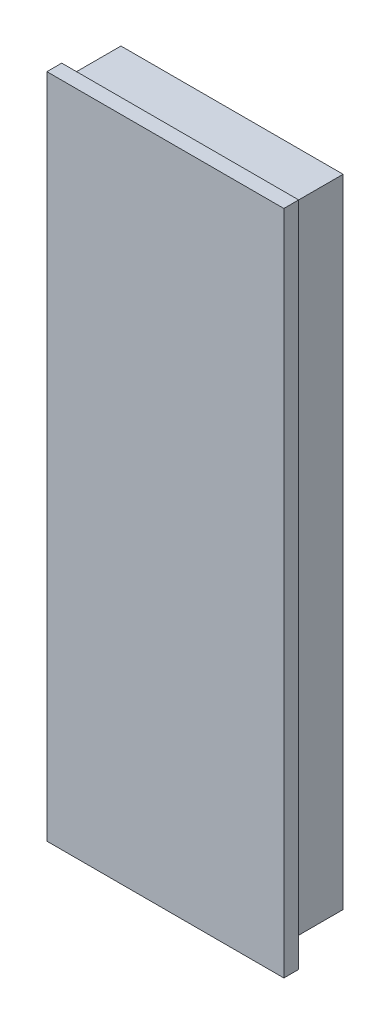
ISO-10303-21;
HEADER;
FILE_DESCRIPTION(('STEP AP214'),'2;1');
FILE_NAME('part.step','',(''),(''),'','','');
FILE_SCHEMA(('AUTOMOTIVE_DESIGN { 1 0 10303 214 1 1 1 1 }'));
ENDSEC;
DATA;
#1=APPLICATION_CONTEXT('core data for automotive mechanical design processes');
#2=APPLICATION_PROTOCOL_DEFINITION('international standard','automotive_design',2000,#1);
#3=PRODUCT_CONTEXT('',#1,'mechanical');
#4=PRODUCT('Part','Part','',(#3));
#5=PRODUCT_RELATED_PRODUCT_CATEGORY('part','',(#4));
#6=PRODUCT_DEFINITION_FORMATION('','',#4);
#7=PRODUCT_DEFINITION_CONTEXT('part definition',#1,'design');
#8=PRODUCT_DEFINITION('design','',#6,#7);
#9=PRODUCT_DEFINITION_SHAPE('','',#8);
#10=(LENGTH_UNIT() NAMED_UNIT(*) SI_UNIT(.MILLI.,.METRE.));
#11=(NAMED_UNIT(*) PLANE_ANGLE_UNIT() SI_UNIT($,.RADIAN.));
#12=(NAMED_UNIT(*) SI_UNIT($,.STERADIAN.) SOLID_ANGLE_UNIT());
#13=UNCERTAINTY_MEASURE_WITH_UNIT(LENGTH_MEASURE(1.E-05),#10,'distance_accuracy_value','');
#14=(GEOMETRIC_REPRESENTATION_CONTEXT(3) GLOBAL_UNCERTAINTY_ASSIGNED_CONTEXT((#13)) GLOBAL_UNIT_ASSIGNED_CONTEXT((#10,
#11,#12)) REPRESENTATION_CONTEXT('',''));
#15=CARTESIAN_POINT('',(0.,0.,0.));
#16=DIRECTION('',(0.,0.,1.));
#17=DIRECTION('',(1.,0.,0.));
#18=AXIS2_PLACEMENT_3D('',#15,#16,#17);
#19=CARTESIAN_POINT('',(7.49999999999999,21.5,4.));
#20=DIRECTION('',(-1.,0.,0.));
#21=DIRECTION('',(0.,-1.,0.));
#22=AXIS2_PLACEMENT_3D('',#19,#20,#21);
#23=PLANE('',#22);
#24=DIRECTION('',(0.,1.,0.));
#25=VECTOR('',#24,1.);
#26=CARTESIAN_POINT('',(7.49999999999999,21.5,0.));
#27=LINE('',#26,#25);
#28=CARTESIAN_POINT('',(7.5,-21.5,0.));
#29=VERTEX_POINT('',#28);
#30=CARTESIAN_POINT('',(7.49999999999999,21.5,0.));
#31=VERTEX_POINT('',#30);
#32=EDGE_CURVE('E132',#29,#31,#27,.T.);
#33=ORIENTED_EDGE('',*,*,#32,.T.);
#34=DIRECTION('',(0.,0.,-1.));
#35=VECTOR('',#34,1.);
#36=CARTESIAN_POINT('',(7.49999999999999,21.5,4.));
#37=LINE('',#36,#35);
#38=CARTESIAN_POINT('',(7.49999999999999,21.5,4.));
#39=VERTEX_POINT('',#38);
#40=EDGE_CURVE('E11',#39,#31,#37,.T.);
#41=ORIENTED_EDGE('',*,*,#40,.F.);
#42=DIRECTION('',(0.,1.,0.));
#43=VECTOR('',#42,1.);
#44=CARTESIAN_POINT('',(7.49999999999999,21.5,4.));
#45=LINE('',#44,#43);
#46=CARTESIAN_POINT('',(7.5,-21.5,4.));
#47=VERTEX_POINT('',#46);
#48=EDGE_CURVE('E141',#47,#39,#45,.T.);
#49=ORIENTED_EDGE('',*,*,#48,.F.);
#50=DIRECTION('',(0.,0.,-1.));
#51=VECTOR('',#50,1.);
#52=CARTESIAN_POINT('',(7.5,-21.5,4.));
#53=LINE('',#52,#51);
#54=EDGE_CURVE('E147',#47,#29,#53,.T.);
#55=ORIENTED_EDGE('',*,*,#54,.T.);
#56=EDGE_LOOP('',(#33,#41,#49,#55));
#57=FACE_BOUND('',#56,.T.);
#58=ADVANCED_FACE('F36',(#57),#23,.F.);
#59=CARTESIAN_POINT('',(-7.50000000000001,21.5,4.));
#60=DIRECTION('',(0.,-1.,0.));
#61=DIRECTION('',(0.,0.,-1.));
#62=AXIS2_PLACEMENT_3D('',#59,#60,#61);
#63=PLANE('',#62);
#64=DIRECTION('',(-1.,0.,0.));
#65=VECTOR('',#64,1.);
#66=CARTESIAN_POINT('',(-7.50000000000001,21.5,0.));
#67=LINE('',#66,#65);
#68=CARTESIAN_POINT('',(-7.50000000000001,21.5,0.));
#69=VERTEX_POINT('',#68);
#70=EDGE_CURVE('E135',#31,#69,#67,.T.);
#71=ORIENTED_EDGE('',*,*,#70,.T.);
#72=DIRECTION('',(0.,0.,-1.));
#73=VECTOR('',#72,1.);
#74=CARTESIAN_POINT('',(-7.50000000000001,21.5,4.));
#75=LINE('',#74,#73);
#76=CARTESIAN_POINT('',(-7.50000000000001,21.5,4.));
#77=VERTEX_POINT('',#76);
#78=EDGE_CURVE('E44',#77,#69,#75,.T.);
#79=ORIENTED_EDGE('',*,*,#78,.F.);
#80=DIRECTION('',(-1.,0.,0.));
#81=VECTOR('',#80,1.);
#82=CARTESIAN_POINT('',(-7.50000000000001,21.5,4.));
#83=LINE('',#82,#81);
#84=EDGE_CURVE('E78',#39,#77,#83,.T.);
#85=ORIENTED_EDGE('',*,*,#84,.F.);
#86=ORIENTED_EDGE('',*,*,#40,.T.);
#87=EDGE_LOOP('',(#71,#79,#85,#86));
#88=FACE_BOUND('',#87,.T.);
#89=ADVANCED_FACE('F190',(#88),#63,.F.);
#90=CARTESIAN_POINT('',(-7.50000000000001,21.5,4.));
#91=DIRECTION('',(1.,0.,0.));
#92=DIRECTION('',(0.,1.,0.));
#93=AXIS2_PLACEMENT_3D('',#90,#91,#92);
#94=PLANE('',#93);
#95=DIRECTION('',(0.,-1.,0.));
#96=VECTOR('',#95,1.);
#97=CARTESIAN_POINT('',(-7.50000000000001,21.5,0.));
#98=LINE('',#97,#96);
#99=CARTESIAN_POINT('',(-7.5,-21.5,0.));
#100=VERTEX_POINT('',#99);
#101=EDGE_CURVE('E68',#69,#100,#98,.T.);
#102=ORIENTED_EDGE('',*,*,#101,.T.);
#103=DIRECTION('',(0.,0.,-1.));
#104=VECTOR('',#103,1.);
#105=CARTESIAN_POINT('',(-7.5,-21.5,4.));
#106=LINE('',#105,#104);
#107=CARTESIAN_POINT('',(-7.5,-21.5,4.));
#108=VERTEX_POINT('',#107);
#109=EDGE_CURVE('E52',#108,#100,#106,.T.);
#110=ORIENTED_EDGE('',*,*,#109,.F.);
#111=DIRECTION('',(0.,-1.,0.));
#112=VECTOR('',#111,1.);
#113=CARTESIAN_POINT('',(-7.50000000000001,22.5,4.));
#114=LINE('',#113,#112);
#115=CARTESIAN_POINT('',(-7.5,-22.5,4.));
#116=VERTEX_POINT('',#115);
#117=EDGE_CURVE('E130',#108,#116,#114,.T.);
#118=ORIENTED_EDGE('',*,*,#117,.T.);
#119=DIRECTION('',(0.,0.,-1.));
#120=VECTOR('',#119,1.);
#121=CARTESIAN_POINT('',(-7.5,-22.5,5.));
#122=LINE('',#121,#120);
#123=CARTESIAN_POINT('',(-7.5,-22.5,5.));
#124=VERTEX_POINT('',#123);
#125=EDGE_CURVE('E112',#124,#116,#122,.T.);
#126=ORIENTED_EDGE('',*,*,#125,.F.);
#127=DIRECTION('',(0.,-1.,0.));
#128=VECTOR('',#127,1.);
#129=CARTESIAN_POINT('',(-7.50000000000001,22.5,5.));
#130=LINE('',#129,#128);
#131=CARTESIAN_POINT('',(-7.50000000000001,22.5,5.));
#132=VERTEX_POINT('',#131);
#133=EDGE_CURVE('E118',#132,#124,#130,.T.);
#134=ORIENTED_EDGE('',*,*,#133,.F.);
#135=DIRECTION('',(0.,0.,-1.));
#136=VECTOR('',#135,1.);
#137=CARTESIAN_POINT('',(-7.50000000000001,22.5,5.));
#138=LINE('',#137,#136);
#139=CARTESIAN_POINT('',(-7.50000000000001,22.5,4.));
#140=VERTEX_POINT('',#139);
#141=EDGE_CURVE('E173',#132,#140,#138,.T.);
#142=ORIENTED_EDGE('',*,*,#141,.T.);
#143=EDGE_CURVE('E155',#140,#77,#114,.T.);
#144=ORIENTED_EDGE('',*,*,#143,.T.);
#145=ORIENTED_EDGE('',*,*,#78,.T.);
#146=EDGE_LOOP('',(#102,#110,#118,#126,#134,#142,#144,#145));
#147=FACE_BOUND('',#146,.T.);
#148=ADVANCED_FACE('F128',(#147),#94,.F.);
#149=CARTESIAN_POINT('',(-7.5,-21.5,4.));
#150=DIRECTION('',(0.,1.,0.));
#151=DIRECTION('',(0.,0.,1.));
#152=AXIS2_PLACEMENT_3D('',#149,#150,#151);
#153=PLANE('',#152);
#154=DIRECTION('',(1.,0.,0.));
#155=VECTOR('',#154,1.);
#156=CARTESIAN_POINT('',(-7.5,-21.5,0.));
#157=LINE('',#156,#155);
#158=EDGE_CURVE('E73',#100,#29,#157,.T.);
#159=ORIENTED_EDGE('',*,*,#158,.T.);
#160=ORIENTED_EDGE('',*,*,#54,.F.);
#161=DIRECTION('',(1.,0.,0.));
#162=VECTOR('',#161,1.);
#163=CARTESIAN_POINT('',(-7.5,-21.5,4.));
#164=LINE('',#163,#162);
#165=EDGE_CURVE('E145',#108,#47,#164,.T.);
#166=ORIENTED_EDGE('',*,*,#165,.F.);
#167=ORIENTED_EDGE('',*,*,#109,.T.);
#168=EDGE_LOOP('',(#159,#160,#166,#167));
#169=FACE_BOUND('',#168,.T.);
#170=ADVANCED_FACE('F160',(#169),#153,.F.);
#171=CARTESIAN_POINT('',(0.,0.,0.));
#172=DIRECTION('',(0.,0.,1.));
#173=DIRECTION('',(1.,0.,0.));
#174=AXIS2_PLACEMENT_3D('',#171,#172,#173);
#175=PLANE('',#174);
#176=ORIENTED_EDGE('',*,*,#32,.F.);
#177=ORIENTED_EDGE('',*,*,#158,.F.);
#178=ORIENTED_EDGE('',*,*,#101,.F.);
#179=ORIENTED_EDGE('',*,*,#70,.F.);
#180=EDGE_LOOP('',(#176,#177,#178,#179));
#181=FACE_BOUND('',#180,.T.);
#182=ADVANCED_FACE('F158',(#181),#175,.F.);
#183=CARTESIAN_POINT('',(0.,0.,4.));
#184=DIRECTION('',(0.,0.,1.));
#185=DIRECTION('',(1.,0.,0.));
#186=AXIS2_PLACEMENT_3D('',#183,#184,#185);
#187=PLANE('',#186);
#188=ORIENTED_EDGE('',*,*,#48,.T.);
#189=ORIENTED_EDGE('',*,*,#84,.T.);
#190=ORIENTED_EDGE('',*,*,#143,.F.);
#191=DIRECTION('',(-1.,0.,0.));
#192=VECTOR('',#191,1.);
#193=CARTESIAN_POINT('',(-7.50000000000001,22.5,4.));
#194=LINE('',#193,#192);
#195=CARTESIAN_POINT('',(8.49999999999999,22.5,4.));
#196=VERTEX_POINT('',#195);
#197=EDGE_CURVE('E126',#196,#140,#194,.T.);
#198=ORIENTED_EDGE('',*,*,#197,.F.);
#199=DIRECTION('',(0.,1.,0.));
#200=VECTOR('',#199,1.);
#201=CARTESIAN_POINT('',(8.49999999999999,22.5,4.));
#202=LINE('',#201,#200);
#203=CARTESIAN_POINT('',(8.5,-22.5,4.));
#204=VERTEX_POINT('',#203);
#205=EDGE_CURVE('E170',#204,#196,#202,.T.);
#206=ORIENTED_EDGE('',*,*,#205,.F.);
#207=DIRECTION('',(1.,0.,0.));
#208=VECTOR('',#207,1.);
#209=CARTESIAN_POINT('',(-7.5,-22.5,4.));
#210=LINE('',#209,#208);
#211=EDGE_CURVE('E164',#116,#204,#210,.T.);
#212=ORIENTED_EDGE('',*,*,#211,.F.);
#213=ORIENTED_EDGE('',*,*,#117,.F.);
#214=ORIENTED_EDGE('',*,*,#165,.T.);
#215=EDGE_LOOP('',(#188,#189,#190,#198,#206,#212,#213,#214));
#216=FACE_BOUND('',#215,.T.);
#217=ADVANCED_FACE('F162',(#216),#187,.F.);
#218=CARTESIAN_POINT('',(-7.5,-22.5,5.));
#219=DIRECTION('',(0.,1.,0.));
#220=DIRECTION('',(0.,0.,1.));
#221=AXIS2_PLACEMENT_3D('',#218,#219,#220);
#222=PLANE('',#221);
#223=ORIENTED_EDGE('',*,*,#211,.T.);
#224=DIRECTION('',(0.,0.,-1.));
#225=VECTOR('',#224,1.);
#226=CARTESIAN_POINT('',(8.5,-22.5,5.));
#227=LINE('',#226,#225);
#228=CARTESIAN_POINT('',(8.5,-22.5,5.));
#229=VERTEX_POINT('',#228);
#230=EDGE_CURVE('E114',#229,#204,#227,.T.);
#231=ORIENTED_EDGE('',*,*,#230,.F.);
#232=DIRECTION('',(1.,0.,0.));
#233=VECTOR('',#232,1.);
#234=CARTESIAN_POINT('',(-7.5,-22.5,5.));
#235=LINE('',#234,#233);
#236=EDGE_CURVE('E108',#124,#229,#235,.T.);
#237=ORIENTED_EDGE('',*,*,#236,.F.);
#238=ORIENTED_EDGE('',*,*,#125,.T.);
#239=EDGE_LOOP('',(#223,#231,#237,#238));
#240=FACE_BOUND('',#239,.T.);
#241=ADVANCED_FACE('F110',(#240),#222,.F.);
#242=CARTESIAN_POINT('',(8.49999999999999,22.5,5.));
#243=DIRECTION('',(-1.,0.,0.));
#244=DIRECTION('',(0.,-1.,0.));
#245=AXIS2_PLACEMENT_3D('',#242,#243,#244);
#246=PLANE('',#245);
#247=ORIENTED_EDGE('',*,*,#205,.T.);
#248=DIRECTION('',(0.,0.,-1.));
#249=VECTOR('',#248,1.);
#250=CARTESIAN_POINT('',(8.49999999999999,22.5,5.));
#251=LINE('',#250,#249);
#252=CARTESIAN_POINT('',(8.49999999999999,22.5,5.));
#253=VERTEX_POINT('',#252);
#254=EDGE_CURVE('E137',#253,#196,#251,.T.);
#255=ORIENTED_EDGE('',*,*,#254,.F.);
#256=DIRECTION('',(0.,1.,0.));
#257=VECTOR('',#256,1.);
#258=CARTESIAN_POINT('',(8.49999999999999,22.5,5.));
#259=LINE('',#258,#257);
#260=EDGE_CURVE('E117',#229,#253,#259,.T.);
#261=ORIENTED_EDGE('',*,*,#260,.F.);
#262=ORIENTED_EDGE('',*,*,#230,.T.);
#263=EDGE_LOOP('',(#247,#255,#261,#262));
#264=FACE_BOUND('',#263,.T.);
#265=ADVANCED_FACE('F180',(#264),#246,.F.);
#266=CARTESIAN_POINT('',(-7.50000000000001,22.5,5.));
#267=DIRECTION('',(0.,-1.,0.));
#268=DIRECTION('',(0.,0.,-1.));
#269=AXIS2_PLACEMENT_3D('',#266,#267,#268);
#270=PLANE('',#269);
#271=ORIENTED_EDGE('',*,*,#197,.T.);
#272=ORIENTED_EDGE('',*,*,#141,.F.);
#273=DIRECTION('',(-1.,0.,0.));
#274=VECTOR('',#273,1.);
#275=CARTESIAN_POINT('',(-7.50000000000001,22.5,5.));
#276=LINE('',#275,#274);
#277=EDGE_CURVE('E123',#253,#132,#276,.T.);
#278=ORIENTED_EDGE('',*,*,#277,.F.);
#279=ORIENTED_EDGE('',*,*,#254,.T.);
#280=EDGE_LOOP('',(#271,#272,#278,#279));
#281=FACE_BOUND('',#280,.T.);
#282=ADVANCED_FACE('F178',(#281),#270,.F.);
#283=CARTESIAN_POINT('',(0.,0.,5.));
#284=DIRECTION('',(0.,0.,1.));
#285=DIRECTION('',(1.,0.,0.));
#286=AXIS2_PLACEMENT_3D('',#283,#284,#285);
#287=PLANE('',#286);
#288=ORIENTED_EDGE('',*,*,#133,.T.);
#289=ORIENTED_EDGE('',*,*,#236,.T.);
#290=ORIENTED_EDGE('',*,*,#260,.T.);
#291=ORIENTED_EDGE('',*,*,#277,.T.);
#292=EDGE_LOOP('',(#288,#289,#290,#291));
#293=FACE_BOUND('',#292,.T.);
#294=ADVANCED_FACE('F121',(#293),#287,.T.);
#295=CLOSED_SHELL('',(#58,#89,#148,#170,#182,#217,#241,#265,#282,#294));
#296=MANIFOLD_SOLID_BREP('B2',#295);
#297=ADVANCED_BREP_SHAPE_REPRESENTATION('',(#18,#296),#14);
#298=SHAPE_DEFINITION_REPRESENTATION(#9,#297);
ENDSEC;
END-ISO-10303-21;
